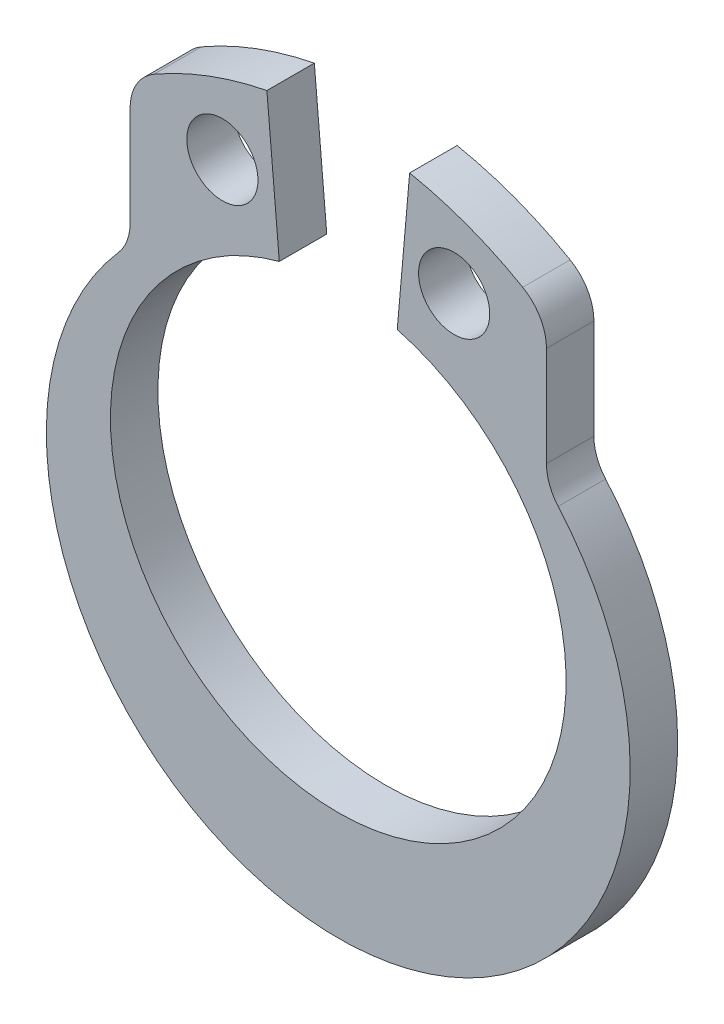
ISO-10303-21;
HEADER;
FILE_DESCRIPTION(('STEP AP214'),'2;1');
FILE_NAME('part.step','',(''),(''),'','','');
FILE_SCHEMA(('AUTOMOTIVE_DESIGN { 1 0 10303 214 1 1 1 1 }'));
ENDSEC;
DATA;
#1=APPLICATION_CONTEXT('core data for automotive mechanical design processes');
#2=APPLICATION_PROTOCOL_DEFINITION('international standard','automotive_design',2000,#1);
#3=PRODUCT_CONTEXT('',#1,'mechanical');
#4=PRODUCT('Part','Part','',(#3));
#5=PRODUCT_RELATED_PRODUCT_CATEGORY('part','',(#4));
#6=PRODUCT_DEFINITION_FORMATION('','',#4);
#7=PRODUCT_DEFINITION_CONTEXT('part definition',#1,'design');
#8=PRODUCT_DEFINITION('design','',#6,#7);
#9=PRODUCT_DEFINITION_SHAPE('','',#8);
#10=(LENGTH_UNIT() NAMED_UNIT(*) SI_UNIT(.MILLI.,.METRE.));
#11=(NAMED_UNIT(*) PLANE_ANGLE_UNIT() SI_UNIT($,.RADIAN.));
#12=(NAMED_UNIT(*) SI_UNIT($,.STERADIAN.) SOLID_ANGLE_UNIT());
#13=UNCERTAINTY_MEASURE_WITH_UNIT(LENGTH_MEASURE(1.E-05),#10,'distance_accuracy_value','');
#14=(GEOMETRIC_REPRESENTATION_CONTEXT(3) GLOBAL_UNCERTAINTY_ASSIGNED_CONTEXT((#13)) GLOBAL_UNIT_ASSIGNED_CONTEXT((#10,
#11,#12)) REPRESENTATION_CONTEXT('',''));
#15=CARTESIAN_POINT('',(0.,0.,0.));
#16=DIRECTION('',(0.,0.,1.));
#17=DIRECTION('',(1.,0.,0.));
#18=AXIS2_PLACEMENT_3D('',#15,#16,#17);
#19=CARTESIAN_POINT('',(0.,0.939800000000001,1.));
#20=DIRECTION('',(0.,0.,1.));
#21=DIRECTION('',(1.,0.,0.));
#22=AXIS2_PLACEMENT_3D('',#19,#20,#21);
#23=PLANE('',#22);
#24=CARTESIAN_POINT('',(-2.44152029848928,6.83415141742201,1.));
#25=DIRECTION('',(0.,0.,1.));
#26=DIRECTION('',(1.,0.,0.));
#27=AXIS2_PLACEMENT_3D('',#24,#25,#26);
#28=CIRCLE('',#27,0.75);
#29=CARTESIAN_POINT('',(-1.69152029848928,6.83415141742201,1.));
#30=VERTEX_POINT('',#29);
#31=EDGE_CURVE('E145',#30,#30,#28,.T.);
#32=ORIENTED_EDGE('',*,*,#31,.F.);
#33=EDGE_LOOP('',(#32));
#34=FACE_BOUND('',#33,.T.);
#35=CARTESIAN_POINT('',(0.,0.939800000000001,1.));
#36=DIRECTION('',(0.,0.,1.));
#37=DIRECTION('',(1.,0.,0.));
#38=AXIS2_PLACEMENT_3D('',#35,#36,#37);
#39=CIRCLE('',#38,4.8);
#40=CARTESIAN_POINT('',(-1.2423314164921,5.57624396618753,1.));
#41=VERTEX_POINT('',#40);
#42=CARTESIAN_POINT('',(1.2423314164921,5.57624396618753,1.));
#43=VERTEX_POINT('',#42);
#44=EDGE_CURVE('E126',#41,#43,#39,.T.);
#45=ORIENTED_EDGE('',*,*,#44,.F.);
#46=DIRECTION('',(-0.0871557427476591,0.996194698091745,0.));
#47=VECTOR('',#46,1.);
#48=CARTESIAN_POINT('',(-1.2423314164921,5.57624396618753,1.));
#49=LINE('',#48,#47);
#50=CARTESIAN_POINT('',(-1.50379864473508,8.56482806046277,1.));
#51=VERTEX_POINT('',#50);
#52=EDGE_CURVE('E57',#41,#51,#49,.T.);
#53=ORIENTED_EDGE('',*,*,#52,.T.);
#54=CARTESIAN_POINT('',(0.,0.939800000000001,1.));
#55=DIRECTION('',(0.,0.,-1.));
#56=DIRECTION('',(-1.,0.,0.));
#57=AXIS2_PLACEMENT_3D('',#54,#55,#56);
#58=CIRCLE('',#57,7.77190216657104);
#59=CARTESIAN_POINT('',(-3.88595108328553,7.67046471197783,1.));
#60=VERTEX_POINT('',#59);
#61=EDGE_CURVE('E191',#60,#51,#58,.T.);
#62=ORIENTED_EDGE('',*,*,#61,.F.);
#63=CARTESIAN_POINT('',(-3.38595108328553,6.80443930819339,1.));
#64=DIRECTION('',(0.,0.,1.));
#65=DIRECTION('',(1.,0.,0.));
#66=AXIS2_PLACEMENT_3D('',#63,#64,#65);
#67=CIRCLE('',#66,0.999999999999999);
#68=CARTESIAN_POINT('',(-4.38595108328552,6.80443930819339,1.));
#69=VERTEX_POINT('',#68);
#70=EDGE_CURVE('E189',#60,#69,#67,.T.);
#71=ORIENTED_EDGE('',*,*,#70,.T.);
#72=DIRECTION('',(0.,-1.,0.));
#73=VECTOR('',#72,1.);
#74=CARTESIAN_POINT('',(-4.38595108328553,6.80443930819339,1.));
#75=LINE('',#74,#73);
#76=CARTESIAN_POINT('',(-4.38595108328553,4.70255578685203,1.));
#77=VERTEX_POINT('',#76);
#78=EDGE_CURVE('E187',#69,#77,#75,.T.);
#79=ORIENTED_EDGE('',*,*,#78,.T.);
#80=CARTESIAN_POINT('',(-5.38595108328553,4.70255578685203,1.));
#81=DIRECTION('',(0.,0.,-1.));
#82=DIRECTION('',(-1.,0.,0.));
#83=AXIS2_PLACEMENT_3D('',#80,#81,#82);
#84=CIRCLE('',#83,1.);
#85=CARTESIAN_POINT('',(-4.63267121149734,4.04485567680279,1.));
#86=VERTEX_POINT('',#85);
#87=EDGE_CURVE('E185',#77,#86,#84,.T.);
#88=ORIENTED_EDGE('',*,*,#87,.T.);
#89=CARTESIAN_POINT('',(0.,0.,1.));
#90=DIRECTION('',(0.,0.,1.));
#91=DIRECTION('',(1.,0.,0.));
#92=AXIS2_PLACEMENT_3D('',#89,#90,#91);
#93=CIRCLE('',#92,6.15);
#94=CARTESIAN_POINT('',(4.63267121149734,4.04485567680279,1.));
#95=VERTEX_POINT('',#94);
#96=EDGE_CURVE('E183',#86,#95,#93,.T.);
#97=ORIENTED_EDGE('',*,*,#96,.T.);
#98=CARTESIAN_POINT('',(5.38595108328553,4.70255578685203,1.));
#99=DIRECTION('',(0.,0.,-1.));
#100=DIRECTION('',(-1.,0.,0.));
#101=AXIS2_PLACEMENT_3D('',#98,#99,#100);
#102=CIRCLE('',#101,1.);
#103=CARTESIAN_POINT('',(4.38595108328552,4.70255578685204,1.));
#104=VERTEX_POINT('',#103);
#105=EDGE_CURVE('E181',#95,#104,#102,.T.);
#106=ORIENTED_EDGE('',*,*,#105,.T.);
#107=DIRECTION('',(0.,1.,0.));
#108=VECTOR('',#107,1.);
#109=CARTESIAN_POINT('',(4.38595108328552,4.70255578685204,1.));
#110=LINE('',#109,#108);
#111=CARTESIAN_POINT('',(4.38595108328553,6.80443930819339,1.));
#112=VERTEX_POINT('',#111);
#113=EDGE_CURVE('E179',#104,#112,#110,.T.);
#114=ORIENTED_EDGE('',*,*,#113,.T.);
#115=CARTESIAN_POINT('',(3.38595108328553,6.80443930819339,1.));
#116=DIRECTION('',(0.,0.,1.));
#117=DIRECTION('',(1.,0.,0.));
#118=AXIS2_PLACEMENT_3D('',#115,#116,#117);
#119=CIRCLE('',#118,1.);
#120=CARTESIAN_POINT('',(3.88595108328553,7.67046471197783,1.));
#121=VERTEX_POINT('',#120);
#122=EDGE_CURVE('E177',#112,#121,#119,.T.);
#123=ORIENTED_EDGE('',*,*,#122,.T.);
#124=CARTESIAN_POINT('',(0.,0.939800000000001,1.));
#125=DIRECTION('',(0.,0.,-1.));
#126=DIRECTION('',(-1.,0.,0.));
#127=AXIS2_PLACEMENT_3D('',#124,#125,#126);
#128=CIRCLE('',#127,7.77190216657104);
#129=CARTESIAN_POINT('',(1.50379864473508,8.56482806046276,1.));
#130=VERTEX_POINT('',#129);
#131=EDGE_CURVE('E174',#130,#121,#128,.T.);
#132=ORIENTED_EDGE('',*,*,#131,.F.);
#133=DIRECTION('',(0.0871557427476575,0.996194698091746,0.));
#134=VECTOR('',#133,1.);
#135=CARTESIAN_POINT('',(1.2423314164921,5.57624396618753,1.));
#136=LINE('',#135,#134);
#137=EDGE_CURVE('E172',#43,#130,#136,.T.);
#138=ORIENTED_EDGE('',*,*,#137,.F.);
#139=EDGE_LOOP('',(#45,#53,#62,#71,#79,#88,#97,#106,#114,#123,#132,#138));
#140=FACE_BOUND('',#139,.T.);
#141=CARTESIAN_POINT('',(2.44152029848928,6.83415141742201,1.));
#142=DIRECTION('',(0.,0.,1.));
#143=DIRECTION('',(1.,0.,0.));
#144=AXIS2_PLACEMENT_3D('',#141,#142,#143);
#145=CIRCLE('',#144,0.75);
#146=CARTESIAN_POINT('',(3.19152029848928,6.83415141742201,1.));
#147=VERTEX_POINT('',#146);
#148=EDGE_CURVE('E266',#147,#147,#145,.T.);
#149=ORIENTED_EDGE('',*,*,#148,.F.);
#150=EDGE_LOOP('',(#149));
#151=FACE_BOUND('',#150,.T.);
#152=ADVANCED_FACE('F35',(#34,#140,#151),#23,.T.);
#153=CARTESIAN_POINT('',(0.,0.939800000000001,0.));
#154=DIRECTION('',(0.,0.,1.));
#155=DIRECTION('',(1.,0.,0.));
#156=AXIS2_PLACEMENT_3D('',#153,#154,#155);
#157=PLANE('',#156);
#158=CARTESIAN_POINT('',(-2.44152029848928,6.83415141742201,0.));
#159=DIRECTION('',(0.,0.,1.));
#160=DIRECTION('',(1.,0.,0.));
#161=AXIS2_PLACEMENT_3D('',#158,#159,#160);
#162=CIRCLE('',#161,0.75);
#163=CARTESIAN_POINT('',(-1.69152029848928,6.83415141742201,0.));
#164=VERTEX_POINT('',#163);
#165=EDGE_CURVE('E148',#164,#164,#162,.T.);
#166=ORIENTED_EDGE('',*,*,#165,.T.);
#167=EDGE_LOOP('',(#166));
#168=FACE_BOUND('',#167,.T.);
#169=CARTESIAN_POINT('',(0.,0.939800000000001,0.));
#170=DIRECTION('',(0.,0.,1.));
#171=DIRECTION('',(1.,0.,0.));
#172=AXIS2_PLACEMENT_3D('',#169,#170,#171);
#173=CIRCLE('',#172,4.8);
#174=CARTESIAN_POINT('',(-1.2423314164921,5.57624396618753,0.));
#175=VERTEX_POINT('',#174);
#176=CARTESIAN_POINT('',(1.2423314164921,5.57624396618753,0.));
#177=VERTEX_POINT('',#176);
#178=EDGE_CURVE('E125',#175,#177,#173,.T.);
#179=ORIENTED_EDGE('',*,*,#178,.T.);
#180=DIRECTION('',(0.0871557427476575,0.996194698091746,0.));
#181=VECTOR('',#180,1.);
#182=CARTESIAN_POINT('',(1.2423314164921,5.57624396618753,0.));
#183=LINE('',#182,#181);
#184=CARTESIAN_POINT('',(1.50379864473508,8.56482806046276,0.));
#185=VERTEX_POINT('',#184);
#186=EDGE_CURVE('E132',#177,#185,#183,.T.);
#187=ORIENTED_EDGE('',*,*,#186,.T.);
#188=CARTESIAN_POINT('',(0.,0.939800000000001,0.));
#189=DIRECTION('',(0.,0.,-1.));
#190=DIRECTION('',(-1.,0.,0.));
#191=AXIS2_PLACEMENT_3D('',#188,#189,#190);
#192=CIRCLE('',#191,7.77190216657104);
#193=CARTESIAN_POINT('',(3.88595108328553,7.67046471197783,0.));
#194=VERTEX_POINT('',#193);
#195=EDGE_CURVE('E137',#185,#194,#192,.T.);
#196=ORIENTED_EDGE('',*,*,#195,.T.);
#197=CARTESIAN_POINT('',(3.38595108328553,6.80443930819339,0.));
#198=DIRECTION('',(0.,0.,1.));
#199=DIRECTION('',(1.,0.,0.));
#200=AXIS2_PLACEMENT_3D('',#197,#198,#199);
#201=CIRCLE('',#200,1.);
#202=CARTESIAN_POINT('',(4.38595108328553,6.80443930819339,0.));
#203=VERTEX_POINT('',#202);
#204=EDGE_CURVE('E153',#203,#194,#201,.T.);
#205=ORIENTED_EDGE('',*,*,#204,.F.);
#206=DIRECTION('',(0.,1.,0.));
#207=VECTOR('',#206,1.);
#208=CARTESIAN_POINT('',(4.38595108328552,4.70255578685204,0.));
#209=LINE('',#208,#207);
#210=CARTESIAN_POINT('',(4.38595108328552,4.70255578685204,0.));
#211=VERTEX_POINT('',#210);
#212=EDGE_CURVE('E156',#211,#203,#209,.T.);
#213=ORIENTED_EDGE('',*,*,#212,.F.);
#214=CARTESIAN_POINT('',(5.38595108328553,4.70255578685203,0.));
#215=DIRECTION('',(0.,0.,-1.));
#216=DIRECTION('',(-1.,0.,0.));
#217=AXIS2_PLACEMENT_3D('',#214,#215,#216);
#218=CIRCLE('',#217,1.);
#219=CARTESIAN_POINT('',(4.63267121149734,4.04485567680279,0.));
#220=VERTEX_POINT('',#219);
#221=EDGE_CURVE('E158',#220,#211,#218,.T.);
#222=ORIENTED_EDGE('',*,*,#221,.F.);
#223=CARTESIAN_POINT('',(0.,0.,0.));
#224=DIRECTION('',(0.,0.,1.));
#225=DIRECTION('',(1.,0.,0.));
#226=AXIS2_PLACEMENT_3D('',#223,#224,#225);
#227=CIRCLE('',#226,6.15);
#228=CARTESIAN_POINT('',(-4.63267121149734,4.04485567680279,0.));
#229=VERTEX_POINT('',#228);
#230=EDGE_CURVE('E160',#229,#220,#227,.T.);
#231=ORIENTED_EDGE('',*,*,#230,.F.);
#232=CARTESIAN_POINT('',(-5.38595108328553,4.70255578685203,0.));
#233=DIRECTION('',(0.,0.,-1.));
#234=DIRECTION('',(-1.,0.,0.));
#235=AXIS2_PLACEMENT_3D('',#232,#233,#234);
#236=CIRCLE('',#235,1.);
#237=CARTESIAN_POINT('',(-4.38595108328553,4.70255578685203,0.));
#238=VERTEX_POINT('',#237);
#239=EDGE_CURVE('E162',#238,#229,#236,.T.);
#240=ORIENTED_EDGE('',*,*,#239,.F.);
#241=DIRECTION('',(0.,-1.,0.));
#242=VECTOR('',#241,1.);
#243=CARTESIAN_POINT('',(-4.38595108328553,6.80443930819339,0.));
#244=LINE('',#243,#242);
#245=CARTESIAN_POINT('',(-4.38595108328552,6.80443930819339,0.));
#246=VERTEX_POINT('',#245);
#247=EDGE_CURVE('E164',#246,#238,#244,.T.);
#248=ORIENTED_EDGE('',*,*,#247,.F.);
#249=CARTESIAN_POINT('',(-3.38595108328553,6.80443930819339,0.));
#250=DIRECTION('',(0.,0.,1.));
#251=DIRECTION('',(1.,0.,0.));
#252=AXIS2_PLACEMENT_3D('',#249,#250,#251);
#253=CIRCLE('',#252,0.999999999999999);
#254=CARTESIAN_POINT('',(-3.88595108328553,7.67046471197783,0.));
#255=VERTEX_POINT('',#254);
#256=EDGE_CURVE('E166',#255,#246,#253,.T.);
#257=ORIENTED_EDGE('',*,*,#256,.F.);
#258=CARTESIAN_POINT('',(0.,0.939800000000001,0.));
#259=DIRECTION('',(0.,0.,-1.));
#260=DIRECTION('',(-1.,0.,0.));
#261=AXIS2_PLACEMENT_3D('',#258,#259,#260);
#262=CIRCLE('',#261,7.77190216657104);
#263=CARTESIAN_POINT('',(-1.50379864473508,8.56482806046277,0.));
#264=VERTEX_POINT('',#263);
#265=EDGE_CURVE('E168',#255,#264,#262,.T.);
#266=ORIENTED_EDGE('',*,*,#265,.T.);
#267=DIRECTION('',(-0.0871557427476591,0.996194698091745,0.));
#268=VECTOR('',#267,1.);
#269=CARTESIAN_POINT('',(-1.2423314164921,5.57624396618753,0.));
#270=LINE('',#269,#268);
#271=EDGE_CURVE('E144',#175,#264,#270,.T.);
#272=ORIENTED_EDGE('',*,*,#271,.F.);
#273=EDGE_LOOP('',(#179,#187,#196,#205,#213,#222,#231,#240,#248,#257,#266,#272));
#274=FACE_BOUND('',#273,.T.);
#275=CARTESIAN_POINT('',(2.44152029848928,6.83415141742201,0.));
#276=DIRECTION('',(0.,0.,1.));
#277=DIRECTION('',(1.,0.,0.));
#278=AXIS2_PLACEMENT_3D('',#275,#276,#277);
#279=CIRCLE('',#278,0.75);
#280=CARTESIAN_POINT('',(3.19152029848928,6.83415141742201,0.));
#281=VERTEX_POINT('',#280);
#282=EDGE_CURVE('E268',#281,#281,#279,.T.);
#283=ORIENTED_EDGE('',*,*,#282,.T.);
#284=EDGE_LOOP('',(#283));
#285=FACE_BOUND('',#284,.T.);
#286=ADVANCED_FACE('F140',(#168,#274,#285),#157,.F.);
#287=CARTESIAN_POINT('',(0.,0.939800000000001,1.));
#288=DIRECTION('',(0.,0.,-1.));
#289=DIRECTION('',(-1.,0.,0.));
#290=AXIS2_PLACEMENT_3D('',#287,#288,#289);
#291=CYLINDRICAL_SURFACE('',#290,4.8);
#292=ORIENTED_EDGE('',*,*,#178,.F.);
#293=DIRECTION('',(0.,0.,-1.));
#294=VECTOR('',#293,1.);
#295=CARTESIAN_POINT('',(-1.2423314164921,5.57624396618753,1.));
#296=LINE('',#295,#294);
#297=EDGE_CURVE('E11',#41,#175,#296,.T.);
#298=ORIENTED_EDGE('',*,*,#297,.F.);
#299=ORIENTED_EDGE('',*,*,#44,.T.);
#300=DIRECTION('',(0.,0.,-1.));
#301=VECTOR('',#300,1.);
#302=CARTESIAN_POINT('',(1.2423314164921,5.57624396618753,1.));
#303=LINE('',#302,#301);
#304=EDGE_CURVE('E39',#43,#177,#303,.T.);
#305=ORIENTED_EDGE('',*,*,#304,.T.);
#306=EDGE_LOOP('',(#292,#298,#299,#305));
#307=FACE_BOUND('',#306,.T.);
#308=ADVANCED_FACE('F37',(#307),#291,.F.);
#309=CARTESIAN_POINT('',(-1.2423314164921,5.57624396618753,1.));
#310=DIRECTION('',(-0.996194698091745,-0.0871557427476591,0.));
#311=DIRECTION('',(0.0871557427476591,-0.996194698091746,0.));
#312=AXIS2_PLACEMENT_3D('',#309,#310,#311);
#313=PLANE('',#312);
#314=ORIENTED_EDGE('',*,*,#271,.T.);
#315=DIRECTION('',(0.,0.,-1.));
#316=VECTOR('',#315,1.);
#317=CARTESIAN_POINT('',(-1.50379864473508,8.56482806046277,1.));
#318=LINE('',#317,#316);
#319=EDGE_CURVE('E44',#51,#264,#318,.T.);
#320=ORIENTED_EDGE('',*,*,#319,.F.);
#321=ORIENTED_EDGE('',*,*,#52,.F.);
#322=ORIENTED_EDGE('',*,*,#297,.T.);
#323=EDGE_LOOP('',(#314,#320,#321,#322));
#324=FACE_BOUND('',#323,.T.);
#325=ADVANCED_FACE('F259',(#324),#313,.F.);
#326=CARTESIAN_POINT('',(0.,0.939800000000001,1.));
#327=DIRECTION('',(0.,0.,-1.));
#328=DIRECTION('',(-1.,0.,0.));
#329=AXIS2_PLACEMENT_3D('',#326,#327,#328);
#330=CYLINDRICAL_SURFACE('',#329,7.77190216657104);
#331=ORIENTED_EDGE('',*,*,#265,.F.);
#332=DIRECTION('',(0.,0.,-1.));
#333=VECTOR('',#332,1.);
#334=CARTESIAN_POINT('',(-3.88595108328553,7.67046471197783,1.));
#335=LINE('',#334,#333);
#336=EDGE_CURVE('E196',#60,#255,#335,.T.);
#337=ORIENTED_EDGE('',*,*,#336,.F.);
#338=ORIENTED_EDGE('',*,*,#61,.T.);
#339=ORIENTED_EDGE('',*,*,#319,.T.);
#340=EDGE_LOOP('',(#331,#337,#338,#339));
#341=FACE_BOUND('',#340,.T.);
#342=ADVANCED_FACE('F257',(#341),#330,.T.);
#343=CARTESIAN_POINT('',(-3.38595108328553,6.80443930819339,1.));
#344=DIRECTION('',(0.,0.,-1.));
#345=DIRECTION('',(-1.,0.,0.));
#346=AXIS2_PLACEMENT_3D('',#343,#344,#345);
#347=CYLINDRICAL_SURFACE('',#346,0.999999999999999);
#348=ORIENTED_EDGE('',*,*,#256,.T.);
#349=DIRECTION('',(0.,0.,-1.));
#350=VECTOR('',#349,1.);
#351=CARTESIAN_POINT('',(-4.38595108328552,6.80443930819339,1.));
#352=LINE('',#351,#350);
#353=EDGE_CURVE('E198',#69,#246,#352,.T.);
#354=ORIENTED_EDGE('',*,*,#353,.F.);
#355=ORIENTED_EDGE('',*,*,#70,.F.);
#356=ORIENTED_EDGE('',*,*,#336,.T.);
#357=EDGE_LOOP('',(#348,#354,#355,#356));
#358=FACE_BOUND('',#357,.T.);
#359=ADVANCED_FACE('F254',(#358),#347,.T.);
#360=CARTESIAN_POINT('',(-4.38595108328553,6.80443930819339,1.));
#361=DIRECTION('',(1.,0.,0.));
#362=DIRECTION('',(0.,1.,0.));
#363=AXIS2_PLACEMENT_3D('',#360,#361,#362);
#364=PLANE('',#363);
#365=ORIENTED_EDGE('',*,*,#247,.T.);
#366=DIRECTION('',(0.,0.,-1.));
#367=VECTOR('',#366,1.);
#368=CARTESIAN_POINT('',(-4.38595108328553,4.70255578685203,1.));
#369=LINE('',#368,#367);
#370=EDGE_CURVE('E201',#77,#238,#369,.T.);
#371=ORIENTED_EDGE('',*,*,#370,.F.);
#372=ORIENTED_EDGE('',*,*,#78,.F.);
#373=ORIENTED_EDGE('',*,*,#353,.T.);
#374=EDGE_LOOP('',(#365,#371,#372,#373));
#375=FACE_BOUND('',#374,.T.);
#376=ADVANCED_FACE('F250',(#375),#364,.F.);
#377=CARTESIAN_POINT('',(-5.38595108328553,4.70255578685203,1.));
#378=DIRECTION('',(0.,0.,-1.));
#379=DIRECTION('',(-1.,0.,0.));
#380=AXIS2_PLACEMENT_3D('',#377,#378,#379);
#381=CYLINDRICAL_SURFACE('',#380,1.);
#382=ORIENTED_EDGE('',*,*,#239,.T.);
#383=DIRECTION('',(0.,0.,-1.));
#384=VECTOR('',#383,1.);
#385=CARTESIAN_POINT('',(-4.63267121149734,4.04485567680279,1.));
#386=LINE('',#385,#384);
#387=EDGE_CURVE('E204',#86,#229,#386,.T.);
#388=ORIENTED_EDGE('',*,*,#387,.F.);
#389=ORIENTED_EDGE('',*,*,#87,.F.);
#390=ORIENTED_EDGE('',*,*,#370,.T.);
#391=EDGE_LOOP('',(#382,#388,#389,#390));
#392=FACE_BOUND('',#391,.T.);
#393=ADVANCED_FACE('F245',(#392),#381,.F.);
#394=CARTESIAN_POINT('',(0.,0.,1.));
#395=DIRECTION('',(0.,0.,-1.));
#396=DIRECTION('',(-1.,0.,0.));
#397=AXIS2_PLACEMENT_3D('',#394,#395,#396);
#398=CYLINDRICAL_SURFACE('',#397,6.15);
#399=ORIENTED_EDGE('',*,*,#230,.T.);
#400=DIRECTION('',(0.,0.,-1.));
#401=VECTOR('',#400,1.);
#402=CARTESIAN_POINT('',(4.63267121149734,4.04485567680279,1.));
#403=LINE('',#402,#401);
#404=EDGE_CURVE('E207',#95,#220,#403,.T.);
#405=ORIENTED_EDGE('',*,*,#404,.F.);
#406=ORIENTED_EDGE('',*,*,#96,.F.);
#407=ORIENTED_EDGE('',*,*,#387,.T.);
#408=EDGE_LOOP('',(#399,#405,#406,#407));
#409=FACE_BOUND('',#408,.T.);
#410=ADVANCED_FACE('F239',(#409),#398,.T.);
#411=CARTESIAN_POINT('',(5.38595108328553,4.70255578685203,1.));
#412=DIRECTION('',(0.,0.,-1.));
#413=DIRECTION('',(-1.,0.,0.));
#414=AXIS2_PLACEMENT_3D('',#411,#412,#413);
#415=CYLINDRICAL_SURFACE('',#414,1.);
#416=ORIENTED_EDGE('',*,*,#221,.T.);
#417=DIRECTION('',(0.,0.,-1.));
#418=VECTOR('',#417,1.);
#419=CARTESIAN_POINT('',(4.38595108328552,4.70255578685204,1.));
#420=LINE('',#419,#418);
#421=EDGE_CURVE('E210',#104,#211,#420,.T.);
#422=ORIENTED_EDGE('',*,*,#421,.F.);
#423=ORIENTED_EDGE('',*,*,#105,.F.);
#424=ORIENTED_EDGE('',*,*,#404,.T.);
#425=EDGE_LOOP('',(#416,#422,#423,#424));
#426=FACE_BOUND('',#425,.T.);
#427=ADVANCED_FACE('F235',(#426),#415,.F.);
#428=CARTESIAN_POINT('',(4.38595108328552,4.70255578685204,1.));
#429=DIRECTION('',(-1.,0.,0.));
#430=DIRECTION('',(0.,-1.,0.));
#431=AXIS2_PLACEMENT_3D('',#428,#429,#430);
#432=PLANE('',#431);
#433=ORIENTED_EDGE('',*,*,#212,.T.);
#434=DIRECTION('',(0.,0.,-1.));
#435=VECTOR('',#434,1.);
#436=CARTESIAN_POINT('',(4.38595108328553,6.80443930819339,1.));
#437=LINE('',#436,#435);
#438=EDGE_CURVE('E213',#112,#203,#437,.T.);
#439=ORIENTED_EDGE('',*,*,#438,.F.);
#440=ORIENTED_EDGE('',*,*,#113,.F.);
#441=ORIENTED_EDGE('',*,*,#421,.T.);
#442=EDGE_LOOP('',(#433,#439,#440,#441));
#443=FACE_BOUND('',#442,.T.);
#444=ADVANCED_FACE('F230',(#443),#432,.F.);
#445=CARTESIAN_POINT('',(3.38595108328553,6.80443930819339,1.));
#446=DIRECTION('',(0.,0.,-1.));
#447=DIRECTION('',(-1.,0.,0.));
#448=AXIS2_PLACEMENT_3D('',#445,#446,#447);
#449=CYLINDRICAL_SURFACE('',#448,1.);
#450=ORIENTED_EDGE('',*,*,#204,.T.);
#451=DIRECTION('',(0.,0.,-1.));
#452=VECTOR('',#451,1.);
#453=CARTESIAN_POINT('',(3.88595108328553,7.67046471197783,1.));
#454=LINE('',#453,#452);
#455=EDGE_CURVE('E216',#121,#194,#454,.T.);
#456=ORIENTED_EDGE('',*,*,#455,.F.);
#457=ORIENTED_EDGE('',*,*,#122,.F.);
#458=ORIENTED_EDGE('',*,*,#438,.T.);
#459=EDGE_LOOP('',(#450,#456,#457,#458));
#460=FACE_BOUND('',#459,.T.);
#461=ADVANCED_FACE('F224',(#460),#449,.T.);
#462=CARTESIAN_POINT('',(0.,0.939800000000001,1.));
#463=DIRECTION('',(0.,0.,-1.));
#464=DIRECTION('',(-1.,0.,0.));
#465=AXIS2_PLACEMENT_3D('',#462,#463,#464);
#466=CYLINDRICAL_SURFACE('',#465,7.77190216657104);
#467=ORIENTED_EDGE('',*,*,#195,.F.);
#468=DIRECTION('',(0.,0.,-1.));
#469=VECTOR('',#468,1.);
#470=CARTESIAN_POINT('',(1.50379864473508,8.56482806046276,1.));
#471=LINE('',#470,#469);
#472=EDGE_CURVE('E130',#130,#185,#471,.T.);
#473=ORIENTED_EDGE('',*,*,#472,.F.);
#474=ORIENTED_EDGE('',*,*,#131,.T.);
#475=ORIENTED_EDGE('',*,*,#455,.T.);
#476=EDGE_LOOP('',(#467,#473,#474,#475));
#477=FACE_BOUND('',#476,.T.);
#478=ADVANCED_FACE('F219',(#477),#466,.T.);
#479=CARTESIAN_POINT('',(1.2423314164921,5.57624396618753,1.));
#480=DIRECTION('',(-0.996194698091746,0.0871557427476575,0.));
#481=DIRECTION('',(-0.0871557427476575,-0.996194698091746,0.));
#482=AXIS2_PLACEMENT_3D('',#479,#480,#481);
#483=PLANE('',#482);
#484=ORIENTED_EDGE('',*,*,#186,.F.);
#485=ORIENTED_EDGE('',*,*,#304,.F.);
#486=ORIENTED_EDGE('',*,*,#137,.T.);
#487=ORIENTED_EDGE('',*,*,#472,.T.);
#488=EDGE_LOOP('',(#484,#485,#486,#487));
#489=FACE_BOUND('',#488,.T.);
#490=ADVANCED_FACE('F133',(#489),#483,.T.);
#491=CARTESIAN_POINT('',(-2.44152029848928,6.83415141742201,1.));
#492=DIRECTION('',(0.,0.,-1.));
#493=DIRECTION('',(-1.,0.,0.));
#494=AXIS2_PLACEMENT_3D('',#491,#492,#493);
#495=CYLINDRICAL_SURFACE('',#494,0.75);
#496=ORIENTED_EDGE('',*,*,#31,.T.);
#497=EDGE_LOOP('',(#496));
#498=FACE_BOUND('',#497,.T.);
#499=ORIENTED_EDGE('',*,*,#165,.F.);
#500=EDGE_LOOP('',(#499));
#501=FACE_BOUND('',#500,.T.);
#502=ADVANCED_FACE('F277',(#498,#501),#495,.F.);
#503=CARTESIAN_POINT('',(2.44152029848928,6.83415141742201,1.));
#504=DIRECTION('',(0.,0.,-1.));
#505=DIRECTION('',(-1.,0.,0.));
#506=AXIS2_PLACEMENT_3D('',#503,#504,#505);
#507=CYLINDRICAL_SURFACE('',#506,0.75);
#508=ORIENTED_EDGE('',*,*,#148,.T.);
#509=EDGE_LOOP('',(#508));
#510=FACE_BOUND('',#509,.T.);
#511=ORIENTED_EDGE('',*,*,#282,.F.);
#512=EDGE_LOOP('',(#511));
#513=FACE_BOUND('',#512,.T.);
#514=ADVANCED_FACE('F275',(#510,#513),#507,.F.);
#515=CLOSED_SHELL('',(#152,#286,#308,#325,#342,#359,#376,#393,#410,#427,#444,#461,#478,#490,
#502,#514));
#516=MANIFOLD_SOLID_BREP('B2',#515);
#517=ADVANCED_BREP_SHAPE_REPRESENTATION('',(#18,#516),#14);
#518=SHAPE_DEFINITION_REPRESENTATION(#9,#517);
ENDSEC;
END-ISO-10303-21;
